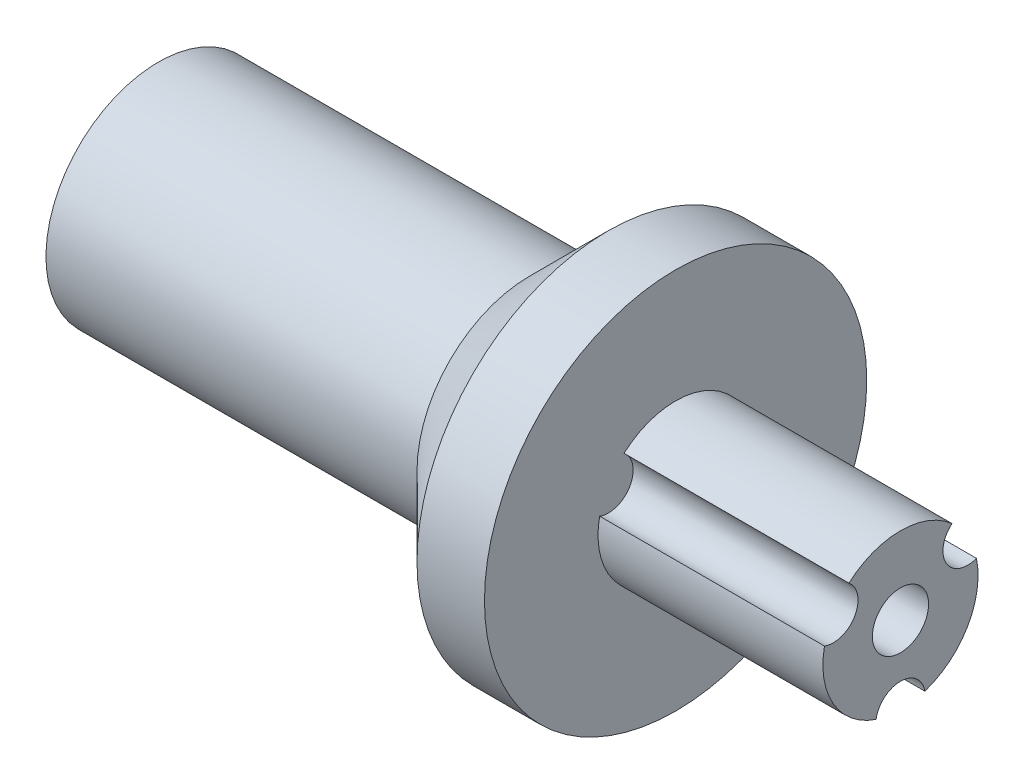
ISO-10303-21;
HEADER;
FILE_DESCRIPTION(('STEP AP214'),'2;1');
FILE_NAME('part.step','',(''),(''),'','','');
FILE_SCHEMA(('AUTOMOTIVE_DESIGN { 1 0 10303 214 1 1 1 1 }'));
ENDSEC;
DATA;
#1=APPLICATION_CONTEXT('core data for automotive mechanical design processes');
#2=APPLICATION_PROTOCOL_DEFINITION('international standard','automotive_design',2000,#1);
#3=PRODUCT_CONTEXT('',#1,'mechanical');
#4=PRODUCT('Part','Part','',(#3));
#5=PRODUCT_RELATED_PRODUCT_CATEGORY('part','',(#4));
#6=PRODUCT_DEFINITION_FORMATION('','',#4);
#7=PRODUCT_DEFINITION_CONTEXT('part definition',#1,'design');
#8=PRODUCT_DEFINITION('design','',#6,#7);
#9=PRODUCT_DEFINITION_SHAPE('','',#8);
#10=(LENGTH_UNIT() NAMED_UNIT(*) SI_UNIT(.MILLI.,.METRE.));
#11=(NAMED_UNIT(*) PLANE_ANGLE_UNIT() SI_UNIT($,.RADIAN.));
#12=(NAMED_UNIT(*) SI_UNIT($,.STERADIAN.) SOLID_ANGLE_UNIT());
#13=UNCERTAINTY_MEASURE_WITH_UNIT(LENGTH_MEASURE(1.E-05),#10,'distance_accuracy_value','');
#14=(GEOMETRIC_REPRESENTATION_CONTEXT(3) GLOBAL_UNCERTAINTY_ASSIGNED_CONTEXT((#13)) GLOBAL_UNIT_ASSIGNED_CONTEXT((#10,
#11,#12)) REPRESENTATION_CONTEXT('',''));
#15=CARTESIAN_POINT('',(0.,0.,0.));
#16=DIRECTION('',(0.,0.,1.));
#17=DIRECTION('',(1.,0.,0.));
#18=AXIS2_PLACEMENT_3D('',#15,#16,#17);
#19=CARTESIAN_POINT('',(0.,0.,0.));
#20=DIRECTION('',(1.,0.,0.));
#21=DIRECTION('',(0.,1.,0.));
#22=AXIS2_PLACEMENT_3D('',#19,#20,#21);
#23=PLANE('',#22);
#24=DIRECTION('',(0.,0.,-1.));
#25=VECTOR('',#24,1.);
#26=CARTESIAN_POINT('',(0.,1.9,1.77482393492989));
#27=LINE('',#26,#25);
#28=CARTESIAN_POINT('',(0.,1.9,1.77482393492989));
#29=VERTEX_POINT('',#28);
#30=CARTESIAN_POINT('',(0.,1.9,-1.77482393492989));
#31=VERTEX_POINT('',#30);
#32=EDGE_CURVE('E11',#29,#31,#27,.T.);
#33=ORIENTED_EDGE('',*,*,#32,.F.);
#34=CARTESIAN_POINT('',(0.,0.,0.));
#35=DIRECTION('',(-1.,0.,0.));
#36=DIRECTION('',(0.,-0.730769230769231,-0.682624590357648));
#37=AXIS2_PLACEMENT_3D('',#34,#35,#36);
#38=CIRCLE('',#37,2.6);
#39=EDGE_CURVE('E195',#31,#29,#38,.T.);
#40=ORIENTED_EDGE('',*,*,#39,.F.);
#41=EDGE_LOOP('',(#33,#40));
#42=FACE_BOUND('',#41,.T.);
#43=CARTESIAN_POINT('',(0.,0.,0.));
#44=DIRECTION('',(1.,0.,0.));
#45=DIRECTION('',(0.,1.,0.));
#46=AXIS2_PLACEMENT_3D('',#43,#44,#45);
#47=CIRCLE('',#46,5.);
#48=CARTESIAN_POINT('',(0.,-5.,0.));
#49=VERTEX_POINT('',#48);
#50=EDGE_CURVE('E124',#49,#49,#47,.T.);
#51=ORIENTED_EDGE('',*,*,#50,.F.);
#52=EDGE_LOOP('',(#51));
#53=FACE_BOUND('',#52,.T.);
#54=ADVANCED_FACE('F16',(#42,#53),#23,.F.);
#55=CARTESIAN_POINT('',(0.,1.9,1.77482393492989));
#56=DIRECTION('',(0.,-1.,0.));
#57=DIRECTION('',(0.,0.,-1.));
#58=AXIS2_PLACEMENT_3D('',#55,#56,#57);
#59=PLANE('',#58);
#60=ORIENTED_EDGE('',*,*,#32,.T.);
#61=DIRECTION('',(1.,0.,0.));
#62=VECTOR('',#61,1.);
#63=CARTESIAN_POINT('',(0.,1.9,-1.77482393492989));
#64=LINE('',#63,#62);
#65=CARTESIAN_POINT('',(20.,1.9,-1.77482393492989));
#66=VERTEX_POINT('',#65);
#67=EDGE_CURVE('E27',#31,#66,#64,.T.);
#68=ORIENTED_EDGE('',*,*,#67,.T.);
#69=DIRECTION('',(0.,0.,-1.));
#70=VECTOR('',#69,1.);
#71=CARTESIAN_POINT('',(20.,1.9,1.77482393492989));
#72=LINE('',#71,#70);
#73=CARTESIAN_POINT('',(20.,1.9,1.77482393492989));
#74=VERTEX_POINT('',#73);
#75=EDGE_CURVE('E225',#74,#66,#72,.T.);
#76=ORIENTED_EDGE('',*,*,#75,.F.);
#77=DIRECTION('',(1.,0.,0.));
#78=VECTOR('',#77,1.);
#79=CARTESIAN_POINT('',(0.,1.9,1.77482393492989));
#80=LINE('',#79,#78);
#81=EDGE_CURVE('E191',#29,#74,#80,.T.);
#82=ORIENTED_EDGE('',*,*,#81,.F.);
#83=EDGE_LOOP('',(#60,#68,#76,#82));
#84=FACE_BOUND('',#83,.T.);
#85=ADVANCED_FACE('F427',(#84),#59,.T.);
#86=CARTESIAN_POINT('',(0.,0.,0.));
#87=DIRECTION('',(1.,0.,0.));
#88=DIRECTION('',(0.,-0.730769230769231,-0.682624590357648));
#89=AXIS2_PLACEMENT_3D('',#86,#87,#88);
#90=CYLINDRICAL_SURFACE('',#89,2.6);
#91=ORIENTED_EDGE('',*,*,#39,.T.);
#92=ORIENTED_EDGE('',*,*,#81,.T.);
#93=CARTESIAN_POINT('',(20.,0.,0.));
#94=DIRECTION('',(-1.,0.,0.));
#95=DIRECTION('',(0.,-0.730769230769231,-0.682624590357648));
#96=AXIS2_PLACEMENT_3D('',#93,#94,#95);
#97=CIRCLE('',#96,2.6);
#98=EDGE_CURVE('E221',#66,#74,#97,.T.);
#99=ORIENTED_EDGE('',*,*,#98,.F.);
#100=ORIENTED_EDGE('',*,*,#67,.F.);
#101=EDGE_LOOP('',(#91,#92,#99,#100));
#102=FACE_BOUND('',#101,.T.);
#103=ADVANCED_FACE('F422',(#102),#90,.F.);
#104=CARTESIAN_POINT('',(20.,0.0876811594202898,0.));
#105=DIRECTION('',(1.,0.,0.));
#106=DIRECTION('',(0.,1.,0.));
#107=AXIS2_PLACEMENT_3D('',#104,#105,#106);
#108=PLANE('',#107);
#109=CARTESIAN_POINT('',(20.,0.,0.));
#110=DIRECTION('',(1.,0.,0.));
#111=DIRECTION('',(0.,0.,-1.));
#112=AXIS2_PLACEMENT_3D('',#109,#110,#111);
#113=CIRCLE('',#112,1.25);
#114=CARTESIAN_POINT('',(20.,0.,1.25));
#115=VERTEX_POINT('',#114);
#116=EDGE_CURVE('E166',#115,#115,#113,.T.);
#117=ORIENTED_EDGE('',*,*,#116,.T.);
#118=EDGE_LOOP('',(#117));
#119=FACE_BOUND('',#118,.T.);
#120=ORIENTED_EDGE('',*,*,#98,.T.);
#121=ORIENTED_EDGE('',*,*,#75,.T.);
#122=EDGE_LOOP('',(#120,#121));
#123=FACE_BOUND('',#122,.T.);
#124=ADVANCED_FACE('F426',(#119,#123),#108,.F.);
#125=CARTESIAN_POINT('',(33.,0.0876811594202898,0.));
#126=DIRECTION('',(1.,0.,0.));
#127=DIRECTION('',(0.,1.,0.));
#128=AXIS2_PLACEMENT_3D('',#125,#126,#127);
#129=PLANE('',#128);
#130=CARTESIAN_POINT('',(33.,0.,0.));
#131=DIRECTION('',(-1.,0.,0.));
#132=DIRECTION('',(0.,0.,-1.));
#133=AXIS2_PLACEMENT_3D('',#130,#131,#132);
#134=CIRCLE('',#133,1.25);
#135=CARTESIAN_POINT('',(33.,0.,1.25));
#136=VERTEX_POINT('',#135);
#137=EDGE_CURVE('E211',#136,#136,#134,.T.);
#138=ORIENTED_EDGE('',*,*,#137,.T.);
#139=EDGE_LOOP('',(#138));
#140=FACE_BOUND('',#139,.T.);
#141=CARTESIAN_POINT('',(33.,0.,0.));
#142=DIRECTION('',(1.,0.,0.));
#143=DIRECTION('',(0.,0.,-1.));
#144=AXIS2_PLACEMENT_3D('',#141,#142,#143);
#145=CIRCLE('',#144,3.45);
#146=CARTESIAN_POINT('',(33.,0.696874242079542,3.37888536217583));
#147=VERTEX_POINT('',#146);
#148=CARTESIAN_POINT('',(33.,-3.27463768115942,1.085931884204));
#149=VERTEX_POINT('',#148);
#150=EDGE_CURVE('E226',#147,#149,#145,.T.);
#151=ORIENTED_EDGE('',*,*,#150,.T.);
#152=CARTESIAN_POINT('',(33.,-3.45,0.));
#153=DIRECTION('',(-1.,0.,0.));
#154=DIRECTION('',(0.,0.,1.));
#155=AXIS2_PLACEMENT_3D('',#152,#153,#154);
#156=CIRCLE('',#155,1.1);
#157=CARTESIAN_POINT('',(33.,-3.27463768115942,-1.085931884204));
#158=VERTEX_POINT('',#157);
#159=EDGE_CURVE('E20',#149,#158,#156,.T.);
#160=ORIENTED_EDGE('',*,*,#159,.T.);
#161=CARTESIAN_POINT('',(33.,0.,0.));
#162=DIRECTION('',(1.,0.,0.));
#163=DIRECTION('',(0.,0.,-1.));
#164=AXIS2_PLACEMENT_3D('',#161,#162,#163);
#165=CIRCLE('',#164,3.45);
#166=CARTESIAN_POINT('',(33.,0.696874242079542,-3.37888536217583));
#167=VERTEX_POINT('',#166);
#168=EDGE_CURVE('E187',#158,#167,#165,.T.);
#169=ORIENTED_EDGE('',*,*,#168,.T.);
#170=CARTESIAN_POINT('',(33.,1.725,-2.98778764305631));
#171=DIRECTION('',(-1.,0.,0.));
#172=DIRECTION('',(0.,0.,1.));
#173=AXIS2_PLACEMENT_3D('',#170,#171,#172);
#174=CIRCLE('',#173,1.1);
#175=CARTESIAN_POINT('',(33.,2.57776343907988,-2.29295347797182));
#176=VERTEX_POINT('',#175);
#177=EDGE_CURVE('E234',#167,#176,#174,.T.);
#178=ORIENTED_EDGE('',*,*,#177,.T.);
#179=CARTESIAN_POINT('',(33.,0.,0.));
#180=DIRECTION('',(1.,0.,0.));
#181=DIRECTION('',(0.,0.,-1.));
#182=AXIS2_PLACEMENT_3D('',#179,#180,#181);
#183=CIRCLE('',#182,3.45);
#184=CARTESIAN_POINT('',(33.,2.57776343907988,2.29295347797182));
#185=VERTEX_POINT('',#184);
#186=EDGE_CURVE('E92',#176,#185,#183,.T.);
#187=ORIENTED_EDGE('',*,*,#186,.T.);
#188=CARTESIAN_POINT('',(33.,1.725,2.98778764305631));
#189=DIRECTION('',(-1.,0.,0.));
#190=DIRECTION('',(0.,0.,1.));
#191=AXIS2_PLACEMENT_3D('',#188,#189,#190);
#192=CIRCLE('',#191,1.1);
#193=EDGE_CURVE('E180',#185,#147,#192,.T.);
#194=ORIENTED_EDGE('',*,*,#193,.T.);
#195=EDGE_LOOP('',(#151,#160,#169,#178,#187,#194));
#196=FACE_BOUND('',#195,.T.);
#197=ADVANCED_FACE('F275',(#140,#196),#129,.T.);
#198=CARTESIAN_POINT('',(20.,0.,0.));
#199=DIRECTION('',(1.,0.,0.));
#200=DIRECTION('',(0.,-0.5,0.866025403784439));
#201=AXIS2_PLACEMENT_3D('',#198,#199,#200);
#202=CYLINDRICAL_SURFACE('',#201,3.45);
#203=CARTESIAN_POINT('',(23.,0.,0.));
#204=DIRECTION('',(1.,0.,0.));
#205=DIRECTION('',(0.,0.,-1.));
#206=AXIS2_PLACEMENT_3D('',#203,#204,#205);
#207=CIRCLE('',#206,3.45);
#208=CARTESIAN_POINT('',(23.,0.696874242079542,3.37888536217583));
#209=VERTEX_POINT('',#208);
#210=CARTESIAN_POINT('',(23.,-3.27463768115942,1.085931884204));
#211=VERTEX_POINT('',#210);
#212=EDGE_CURVE('E153',#209,#211,#207,.T.);
#213=ORIENTED_EDGE('',*,*,#212,.T.);
#214=DIRECTION('',(1.,0.,0.));
#215=VECTOR('',#214,1.);
#216=CARTESIAN_POINT('',(20.,-3.27463768115942,1.085931884204));
#217=LINE('',#216,#215);
#218=EDGE_CURVE('E241',#211,#149,#217,.T.);
#219=ORIENTED_EDGE('',*,*,#218,.T.);
#220=ORIENTED_EDGE('',*,*,#150,.F.);
#221=DIRECTION('',(1.,0.,0.));
#222=VECTOR('',#221,1.);
#223=CARTESIAN_POINT('',(20.,0.696874242079542,3.37888536217583));
#224=LINE('',#223,#222);
#225=EDGE_CURVE('E215',#209,#147,#224,.T.);
#226=ORIENTED_EDGE('',*,*,#225,.F.);
#227=EDGE_LOOP('',(#213,#219,#220,#226));
#228=FACE_BOUND('',#227,.T.);
#229=ADVANCED_FACE('F277',(#228),#202,.T.);
#230=CARTESIAN_POINT('',(20.,-3.45,0.));
#231=DIRECTION('',(1.,0.,0.));
#232=DIRECTION('',(0.,0.,1.));
#233=AXIS2_PLACEMENT_3D('',#230,#231,#232);
#234=CYLINDRICAL_SURFACE('',#233,1.1);
#235=CARTESIAN_POINT('',(23.,-3.45,0.));
#236=DIRECTION('',(-1.,0.,0.));
#237=DIRECTION('',(0.,0.,1.));
#238=AXIS2_PLACEMENT_3D('',#235,#236,#237);
#239=CIRCLE('',#238,1.1);
#240=CARTESIAN_POINT('',(23.,-3.27463768115942,-1.085931884204));
#241=VERTEX_POINT('',#240);
#242=EDGE_CURVE('E199',#211,#241,#239,.T.);
#243=ORIENTED_EDGE('',*,*,#242,.T.);
#244=DIRECTION('',(1.,0.,0.));
#245=VECTOR('',#244,1.);
#246=CARTESIAN_POINT('',(20.,-3.27463768115942,-1.085931884204));
#247=LINE('',#246,#245);
#248=EDGE_CURVE('E190',#241,#158,#247,.T.);
#249=ORIENTED_EDGE('',*,*,#248,.T.);
#250=ORIENTED_EDGE('',*,*,#159,.F.);
#251=ORIENTED_EDGE('',*,*,#218,.F.);
#252=EDGE_LOOP('',(#243,#249,#250,#251));
#253=FACE_BOUND('',#252,.T.);
#254=ADVANCED_FACE('F281',(#253),#234,.F.);
#255=CARTESIAN_POINT('',(20.,1.725,2.98778764305631));
#256=DIRECTION('',(1.,0.,0.));
#257=DIRECTION('',(0.,-0.5,-0.866025403784439));
#258=AXIS2_PLACEMENT_3D('',#255,#256,#257);
#259=CYLINDRICAL_SURFACE('',#258,1.1);
#260=CARTESIAN_POINT('',(23.,1.725,2.98778764305631));
#261=DIRECTION('',(-1.,0.,0.));
#262=DIRECTION('',(0.,0.,1.));
#263=AXIS2_PLACEMENT_3D('',#260,#261,#262);
#264=CIRCLE('',#263,1.1);
#265=CARTESIAN_POINT('',(23.,2.57776343907988,2.29295347797182));
#266=VERTEX_POINT('',#265);
#267=EDGE_CURVE('E186',#266,#209,#264,.T.);
#268=ORIENTED_EDGE('',*,*,#267,.T.);
#269=ORIENTED_EDGE('',*,*,#225,.T.);
#270=ORIENTED_EDGE('',*,*,#193,.F.);
#271=DIRECTION('',(1.,0.,0.));
#272=VECTOR('',#271,1.);
#273=CARTESIAN_POINT('',(20.,2.57776343907988,2.29295347797182));
#274=LINE('',#273,#272);
#275=EDGE_CURVE('E141',#266,#185,#274,.T.);
#276=ORIENTED_EDGE('',*,*,#275,.F.);
#277=EDGE_LOOP('',(#268,#269,#270,#276));
#278=FACE_BOUND('',#277,.T.);
#279=ADVANCED_FACE('F18',(#278),#259,.F.);
#280=CARTESIAN_POINT('',(20.,0.,0.));
#281=DIRECTION('',(1.,0.,0.));
#282=DIRECTION('',(0.,0.,-1.));
#283=AXIS2_PLACEMENT_3D('',#280,#281,#282);
#284=CYLINDRICAL_SURFACE('',#283,3.45);
#285=CARTESIAN_POINT('',(23.,0.,0.));
#286=DIRECTION('',(1.,0.,0.));
#287=DIRECTION('',(0.,0.,-1.));
#288=AXIS2_PLACEMENT_3D('',#285,#286,#287);
#289=CIRCLE('',#288,3.45);
#290=CARTESIAN_POINT('',(23.,2.57776343907988,-2.29295347797182));
#291=VERTEX_POINT('',#290);
#292=EDGE_CURVE('E182',#291,#266,#289,.T.);
#293=ORIENTED_EDGE('',*,*,#292,.T.);
#294=ORIENTED_EDGE('',*,*,#275,.T.);
#295=ORIENTED_EDGE('',*,*,#186,.F.);
#296=DIRECTION('',(1.,0.,0.));
#297=VECTOR('',#296,1.);
#298=CARTESIAN_POINT('',(20.,2.57776343907988,-2.29295347797182));
#299=LINE('',#298,#297);
#300=EDGE_CURVE('E237',#291,#176,#299,.T.);
#301=ORIENTED_EDGE('',*,*,#300,.F.);
#302=EDGE_LOOP('',(#293,#294,#295,#301));
#303=FACE_BOUND('',#302,.T.);
#304=ADVANCED_FACE('F377',(#303),#284,.T.);
#305=CARTESIAN_POINT('',(20.,1.725,-2.98778764305631));
#306=DIRECTION('',(1.,0.,0.));
#307=DIRECTION('',(0.,0.,1.));
#308=AXIS2_PLACEMENT_3D('',#305,#306,#307);
#309=CYLINDRICAL_SURFACE('',#308,1.1);
#310=CARTESIAN_POINT('',(23.,1.725,-2.98778764305631));
#311=DIRECTION('',(-1.,0.,0.));
#312=DIRECTION('',(0.,0.,1.));
#313=AXIS2_PLACEMENT_3D('',#310,#311,#312);
#314=CIRCLE('',#313,1.1);
#315=CARTESIAN_POINT('',(23.,0.696874242079542,-3.37888536217583));
#316=VERTEX_POINT('',#315);
#317=EDGE_CURVE('E185',#316,#291,#314,.T.);
#318=ORIENTED_EDGE('',*,*,#317,.T.);
#319=ORIENTED_EDGE('',*,*,#300,.T.);
#320=ORIENTED_EDGE('',*,*,#177,.F.);
#321=DIRECTION('',(1.,0.,0.));
#322=VECTOR('',#321,1.);
#323=CARTESIAN_POINT('',(20.,0.696874242079542,-3.37888536217583));
#324=LINE('',#323,#322);
#325=EDGE_CURVE('E152',#316,#167,#324,.T.);
#326=ORIENTED_EDGE('',*,*,#325,.F.);
#327=EDGE_LOOP('',(#318,#319,#320,#326));
#328=FACE_BOUND('',#327,.T.);
#329=ADVANCED_FACE('F398',(#328),#309,.F.);
#330=CARTESIAN_POINT('',(20.,0.,0.));
#331=DIRECTION('',(1.,0.,0.));
#332=DIRECTION('',(0.,0.,-1.));
#333=AXIS2_PLACEMENT_3D('',#330,#331,#332);
#334=CYLINDRICAL_SURFACE('',#333,3.45);
#335=CARTESIAN_POINT('',(23.,0.,0.));
#336=DIRECTION('',(1.,0.,0.));
#337=DIRECTION('',(0.,0.,-1.));
#338=AXIS2_PLACEMENT_3D('',#335,#336,#337);
#339=CIRCLE('',#338,3.45);
#340=EDGE_CURVE('E202',#241,#316,#339,.T.);
#341=ORIENTED_EDGE('',*,*,#340,.T.);
#342=ORIENTED_EDGE('',*,*,#325,.T.);
#343=ORIENTED_EDGE('',*,*,#168,.F.);
#344=ORIENTED_EDGE('',*,*,#248,.F.);
#345=EDGE_LOOP('',(#341,#342,#343,#344));
#346=FACE_BOUND('',#345,.T.);
#347=ADVANCED_FACE('F402',(#346),#334,.T.);
#348=CARTESIAN_POINT('',(20.,0.,0.));
#349=DIRECTION('',(1.,0.,0.));
#350=DIRECTION('',(0.,0.,-1.));
#351=AXIS2_PLACEMENT_3D('',#348,#349,#350);
#352=CYLINDRICAL_SURFACE('',#351,8.5);
#353=CARTESIAN_POINT('',(23.,0.,0.));
#354=DIRECTION('',(1.,0.,0.));
#355=DIRECTION('',(0.,0.,-1.));
#356=AXIS2_PLACEMENT_3D('',#353,#354,#355);
#357=CIRCLE('',#356,8.5);
#358=CARTESIAN_POINT('',(23.,0.,8.5));
#359=VERTEX_POINT('',#358);
#360=EDGE_CURVE('E150',#359,#359,#357,.T.);
#361=ORIENTED_EDGE('',*,*,#360,.F.);
#362=DIRECTION('',(-1.,0.,0.));
#363=VECTOR('',#362,1.);
#364=CARTESIAN_POINT('',(20.,0.,8.5));
#365=LINE('',#364,#363);
#366=CARTESIAN_POINT('',(20.,0.,8.5));
#367=VERTEX_POINT('',#366);
#368=EDGE_CURVE('E131',#359,#367,#365,.T.);
#369=ORIENTED_EDGE('',*,*,#368,.T.);
#370=CARTESIAN_POINT('',(20.,0.,0.));
#371=DIRECTION('',(1.,0.,0.));
#372=DIRECTION('',(0.,0.,-1.));
#373=AXIS2_PLACEMENT_3D('',#370,#371,#372);
#374=CIRCLE('',#373,8.5);
#375=CARTESIAN_POINT('',(20.,8.5,0.));
#376=VERTEX_POINT('',#375);
#377=EDGE_CURVE('E148',#367,#376,#374,.T.);
#378=ORIENTED_EDGE('',*,*,#377,.T.);
#379=CARTESIAN_POINT('',(20.,0.,0.));
#380=DIRECTION('',(1.,0.,0.));
#381=DIRECTION('',(0.,0.,-1.));
#382=AXIS2_PLACEMENT_3D('',#379,#380,#381);
#383=CIRCLE('',#382,8.5);
#384=EDGE_CURVE('E159',#376,#367,#383,.T.);
#385=ORIENTED_EDGE('',*,*,#384,.T.);
#386=ORIENTED_EDGE('',*,*,#368,.F.);
#387=EDGE_LOOP('',(#361,#369,#378,#385,#386));
#388=FACE_BOUND('',#387,.T.);
#389=ADVANCED_FACE('F147',(#388),#352,.T.);
#390=CARTESIAN_POINT('',(23.,0.,0.));
#391=DIRECTION('',(1.,0.,0.));
#392=DIRECTION('',(0.,1.,0.));
#393=AXIS2_PLACEMENT_3D('',#390,#391,#392);
#394=PLANE('',#393);
#395=ORIENTED_EDGE('',*,*,#267,.F.);
#396=ORIENTED_EDGE('',*,*,#292,.F.);
#397=ORIENTED_EDGE('',*,*,#317,.F.);
#398=ORIENTED_EDGE('',*,*,#340,.F.);
#399=ORIENTED_EDGE('',*,*,#242,.F.);
#400=ORIENTED_EDGE('',*,*,#212,.F.);
#401=EDGE_LOOP('',(#395,#396,#397,#398,#399,#400));
#402=FACE_BOUND('',#401,.T.);
#403=ORIENTED_EDGE('',*,*,#360,.T.);
#404=EDGE_LOOP('',(#403));
#405=FACE_BOUND('',#404,.T.);
#406=ADVANCED_FACE('F385',(#402,#405),#394,.T.);
#407=CARTESIAN_POINT('',(0.,0.,0.));
#408=DIRECTION('',(1.,0.,0.));
#409=DIRECTION('',(0.,1.,0.));
#410=AXIS2_PLACEMENT_3D('',#407,#408,#409);
#411=CYLINDRICAL_SURFACE('',#410,5.);
#412=CARTESIAN_POINT('',(16.5,0.,0.));
#413=DIRECTION('',(1.,0.,0.));
#414=DIRECTION('',(0.,-1.,0.));
#415=AXIS2_PLACEMENT_3D('',#412,#413,#414);
#416=CIRCLE('',#415,5.);
#417=CARTESIAN_POINT('',(16.5,5.,0.));
#418=VERTEX_POINT('',#417);
#419=CARTESIAN_POINT('',(16.5,-5.,0.));
#420=VERTEX_POINT('',#419);
#421=EDGE_CURVE('E173',#418,#420,#416,.T.);
#422=ORIENTED_EDGE('',*,*,#421,.F.);
#423=CARTESIAN_POINT('',(16.5,0.,0.));
#424=DIRECTION('',(1.,0.,0.));
#425=DIRECTION('',(0.,-1.,0.));
#426=AXIS2_PLACEMENT_3D('',#423,#424,#425);
#427=CIRCLE('',#426,5.);
#428=EDGE_CURVE('E163',#420,#418,#427,.T.);
#429=ORIENTED_EDGE('',*,*,#428,.F.);
#430=DIRECTION('',(-1.,0.,0.));
#431=VECTOR('',#430,1.);
#432=CARTESIAN_POINT('',(0.,-5.,0.));
#433=LINE('',#432,#431);
#434=EDGE_CURVE('E162',#420,#49,#433,.T.);
#435=ORIENTED_EDGE('',*,*,#434,.T.);
#436=ORIENTED_EDGE('',*,*,#50,.T.);
#437=ORIENTED_EDGE('',*,*,#434,.F.);
#438=EDGE_LOOP('',(#422,#429,#435,#436,#437));
#439=FACE_BOUND('',#438,.T.);
#440=ADVANCED_FACE('F259',(#439),#411,.T.);
#441=CARTESIAN_POINT('',(18.25,0.,0.));
#442=DIRECTION('',(1.,0.,0.));
#443=DIRECTION('',(0.,-1.,0.));
#444=AXIS2_PLACEMENT_3D('',#441,#442,#443);
#445=CONICAL_SURFACE('',#444,6.75,0.785398163397448);
#446=ORIENTED_EDGE('',*,*,#384,.F.);
#447=DIRECTION('',(-0.707106781186548,-0.707106781186548,0.));
#448=VECTOR('',#447,1.);
#449=CARTESIAN_POINT('',(18.25,6.75,0.));
#450=LINE('',#449,#448);
#451=EDGE_CURVE('E160',#376,#418,#450,.T.);
#452=ORIENTED_EDGE('',*,*,#451,.T.);
#453=ORIENTED_EDGE('',*,*,#421,.T.);
#454=ORIENTED_EDGE('',*,*,#428,.T.);
#455=ORIENTED_EDGE('',*,*,#451,.F.);
#456=ORIENTED_EDGE('',*,*,#377,.F.);
#457=EDGE_LOOP('',(#446,#452,#453,#454,#455,#456));
#458=FACE_BOUND('',#457,.T.);
#459=ADVANCED_FACE('F157',(#458),#445,.T.);
#460=CARTESIAN_POINT('',(33.,0.,0.));
#461=DIRECTION('',(-1.,0.,0.));
#462=DIRECTION('',(0.,0.,-1.));
#463=AXIS2_PLACEMENT_3D('',#460,#461,#462);
#464=CYLINDRICAL_SURFACE('',#463,1.25);
#465=ORIENTED_EDGE('',*,*,#137,.F.);
#466=DIRECTION('',(-1.,0.,0.));
#467=VECTOR('',#466,1.);
#468=CARTESIAN_POINT('',(33.,0.,1.25));
#469=LINE('',#468,#467);
#470=EDGE_CURVE('E176',#136,#115,#469,.T.);
#471=ORIENTED_EDGE('',*,*,#470,.T.);
#472=ORIENTED_EDGE('',*,*,#116,.F.);
#473=ORIENTED_EDGE('',*,*,#470,.F.);
#474=EDGE_LOOP('',(#465,#471,#472,#473));
#475=FACE_BOUND('',#474,.T.);
#476=ADVANCED_FACE('F389',(#475),#464,.F.);
#477=CLOSED_SHELL('',(#54,#85,#103,#124,#197,#229,#254,#279,#304,#329,#347,#389,#406,#440,#459,#476));
#478=MANIFOLD_SOLID_BREP('B1',#477);
#479=ADVANCED_BREP_SHAPE_REPRESENTATION('',(#18,#478),#14);
#480=SHAPE_DEFINITION_REPRESENTATION(#9,#479);
ENDSEC;
END-ISO-10303-21;
